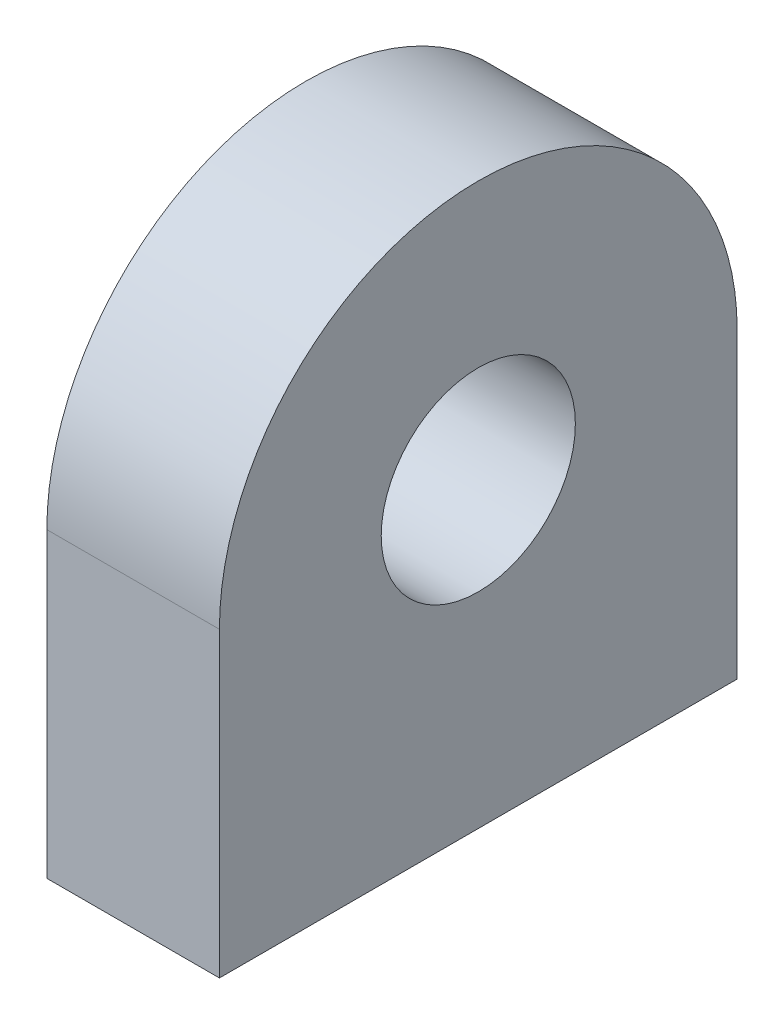
ISO-10303-21;
HEADER;
FILE_DESCRIPTION(('STEP AP214'),'2;1');
FILE_NAME('part.step','',(''),(''),'','','');
FILE_SCHEMA(('AUTOMOTIVE_DESIGN { 1 0 10303 214 1 1 1 1 }'));
ENDSEC;
DATA;
#1=APPLICATION_CONTEXT('core data for automotive mechanical design processes');
#2=APPLICATION_PROTOCOL_DEFINITION('international standard','automotive_design',2000,#1);
#3=PRODUCT_CONTEXT('',#1,'mechanical');
#4=PRODUCT('Part','Part','',(#3));
#5=PRODUCT_RELATED_PRODUCT_CATEGORY('part','',(#4));
#6=PRODUCT_DEFINITION_FORMATION('','',#4);
#7=PRODUCT_DEFINITION_CONTEXT('part definition',#1,'design');
#8=PRODUCT_DEFINITION('design','',#6,#7);
#9=PRODUCT_DEFINITION_SHAPE('','',#8);
#10=(LENGTH_UNIT() NAMED_UNIT(*) SI_UNIT(.MILLI.,.METRE.));
#11=(NAMED_UNIT(*) PLANE_ANGLE_UNIT() SI_UNIT($,.RADIAN.));
#12=(NAMED_UNIT(*) SI_UNIT($,.STERADIAN.) SOLID_ANGLE_UNIT());
#13=UNCERTAINTY_MEASURE_WITH_UNIT(LENGTH_MEASURE(1.E-05),#10,'distance_accuracy_value','');
#14=(GEOMETRIC_REPRESENTATION_CONTEXT(3) GLOBAL_UNCERTAINTY_ASSIGNED_CONTEXT((#13)) GLOBAL_UNIT_ASSIGNED_CONTEXT((#10,
#11,#12)) REPRESENTATION_CONTEXT('',''));
#15=CARTESIAN_POINT('',(0.,0.,0.));
#16=DIRECTION('',(0.,0.,1.));
#17=DIRECTION('',(1.,0.,0.));
#18=AXIS2_PLACEMENT_3D('',#15,#16,#17);
#19=CARTESIAN_POINT('',(12.7,44.45,0.));
#20=DIRECTION('',(-1.,0.,0.));
#21=DIRECTION('',(0.,0.,1.));
#22=AXIS2_PLACEMENT_3D('',#19,#20,#21);
#23=PLANE('',#22);
#24=DIRECTION('',(0.,-1.,0.));
#25=VECTOR('',#24,1.);
#26=CARTESIAN_POINT('',(12.7,0.,38.1));
#27=LINE('',#26,#25);
#28=CARTESIAN_POINT('',(12.7,44.45,38.1));
#29=VERTEX_POINT('',#28);
#30=CARTESIAN_POINT('',(12.7,0.,38.1));
#31=VERTEX_POINT('',#30);
#32=EDGE_CURVE('E85',#29,#31,#27,.T.);
#33=ORIENTED_EDGE('',*,*,#32,.T.);
#34=DIRECTION('',(0.,0.,-1.));
#35=VECTOR('',#34,1.);
#36=CARTESIAN_POINT('',(12.7,0.,38.1));
#37=LINE('',#36,#35);
#38=CARTESIAN_POINT('',(12.7,0.,-38.1));
#39=VERTEX_POINT('',#38);
#40=EDGE_CURVE('E80',#31,#39,#37,.T.);
#41=ORIENTED_EDGE('',*,*,#40,.T.);
#42=DIRECTION('',(0.,1.,0.));
#43=VECTOR('',#42,1.);
#44=CARTESIAN_POINT('',(12.7,0.,-38.1));
#45=LINE('',#44,#43);
#46=CARTESIAN_POINT('',(12.7,44.45,-38.1));
#47=VERTEX_POINT('',#46);
#48=EDGE_CURVE('E83',#39,#47,#45,.T.);
#49=ORIENTED_EDGE('',*,*,#48,.T.);
#50=CARTESIAN_POINT('',(12.7,44.45,0.));
#51=DIRECTION('',(1.,0.,0.));
#52=DIRECTION('',(0.,0.,1.));
#53=AXIS2_PLACEMENT_3D('',#50,#51,#52);
#54=CIRCLE('',#53,38.1);
#55=EDGE_CURVE('E50',#47,#29,#54,.T.);
#56=ORIENTED_EDGE('',*,*,#55,.T.);
#57=EDGE_LOOP('',(#33,#41,#49,#56));
#58=FACE_BOUND('',#57,.T.);
#59=CARTESIAN_POINT('',(12.7,44.45,0.));
#60=DIRECTION('',(1.,0.,0.));
#61=DIRECTION('',(0.,0.,-1.));
#62=AXIS2_PLACEMENT_3D('',#59,#60,#61);
#63=CIRCLE('',#62,14.2875);
#64=CARTESIAN_POINT('',(12.7,44.45,-14.2875));
#65=VERTEX_POINT('',#64);
#66=EDGE_CURVE('E100',#65,#65,#63,.T.);
#67=ORIENTED_EDGE('',*,*,#66,.F.);
#68=EDGE_LOOP('',(#67));
#69=FACE_BOUND('',#68,.T.);
#70=ADVANCED_FACE('F33',(#58,#69),#23,.F.);
#71=CARTESIAN_POINT('',(-12.7,44.45,0.));
#72=DIRECTION('',(-1.,0.,0.));
#73=DIRECTION('',(0.,0.,1.));
#74=AXIS2_PLACEMENT_3D('',#71,#72,#73);
#75=PLANE('',#74);
#76=DIRECTION('',(0.,-1.,0.));
#77=VECTOR('',#76,1.);
#78=CARTESIAN_POINT('',(-12.7,0.,38.1));
#79=LINE('',#78,#77);
#80=CARTESIAN_POINT('',(-12.7,44.45,38.1));
#81=VERTEX_POINT('',#80);
#82=CARTESIAN_POINT('',(-12.7,0.,38.1));
#83=VERTEX_POINT('',#82);
#84=EDGE_CURVE('E97',#81,#83,#79,.T.);
#85=ORIENTED_EDGE('',*,*,#84,.F.);
#86=CARTESIAN_POINT('',(-12.7,44.45,0.));
#87=DIRECTION('',(1.,0.,0.));
#88=DIRECTION('',(0.,0.,1.));
#89=AXIS2_PLACEMENT_3D('',#86,#87,#88);
#90=CIRCLE('',#89,38.1);
#91=CARTESIAN_POINT('',(-12.7,44.45,-38.1));
#92=VERTEX_POINT('',#91);
#93=EDGE_CURVE('E73',#92,#81,#90,.T.);
#94=ORIENTED_EDGE('',*,*,#93,.F.);
#95=DIRECTION('',(0.,1.,0.));
#96=VECTOR('',#95,1.);
#97=CARTESIAN_POINT('',(-12.7,0.,-38.1));
#98=LINE('',#97,#96);
#99=CARTESIAN_POINT('',(-12.7,0.,-38.1));
#100=VERTEX_POINT('',#99);
#101=EDGE_CURVE('E67',#100,#92,#98,.T.);
#102=ORIENTED_EDGE('',*,*,#101,.F.);
#103=DIRECTION('',(0.,0.,-1.));
#104=VECTOR('',#103,1.);
#105=CARTESIAN_POINT('',(-12.7,0.,38.1));
#106=LINE('',#105,#104);
#107=EDGE_CURVE('E89',#83,#100,#106,.T.);
#108=ORIENTED_EDGE('',*,*,#107,.F.);
#109=EDGE_LOOP('',(#85,#94,#102,#108));
#110=FACE_BOUND('',#109,.T.);
#111=CARTESIAN_POINT('',(-12.7,44.45,0.));
#112=DIRECTION('',(1.,0.,0.));
#113=DIRECTION('',(0.,0.,-1.));
#114=AXIS2_PLACEMENT_3D('',#111,#112,#113);
#115=CIRCLE('',#114,14.2875);
#116=CARTESIAN_POINT('',(-12.7,44.45,-14.2875));
#117=VERTEX_POINT('',#116);
#118=EDGE_CURVE('E112',#117,#117,#115,.T.);
#119=ORIENTED_EDGE('',*,*,#118,.T.);
#120=EDGE_LOOP('',(#119));
#121=FACE_BOUND('',#120,.T.);
#122=ADVANCED_FACE('F108',(#110,#121),#75,.T.);
#123=CARTESIAN_POINT('',(12.7,0.,38.1));
#124=DIRECTION('',(0.,0.,-1.));
#125=DIRECTION('',(-1.,0.,0.));
#126=AXIS2_PLACEMENT_3D('',#123,#124,#125);
#127=PLANE('',#126);
#128=ORIENTED_EDGE('',*,*,#84,.T.);
#129=DIRECTION('',(-1.,0.,0.));
#130=VECTOR('',#129,1.);
#131=CARTESIAN_POINT('',(12.7,0.,38.1));
#132=LINE('',#131,#130);
#133=EDGE_CURVE('E11',#31,#83,#132,.T.);
#134=ORIENTED_EDGE('',*,*,#133,.F.);
#135=ORIENTED_EDGE('',*,*,#32,.F.);
#136=DIRECTION('',(-1.,0.,0.));
#137=VECTOR('',#136,1.);
#138=CARTESIAN_POINT('',(12.7,44.45,38.1));
#139=LINE('',#138,#137);
#140=EDGE_CURVE('E93',#29,#81,#139,.T.);
#141=ORIENTED_EDGE('',*,*,#140,.T.);
#142=EDGE_LOOP('',(#128,#134,#135,#141));
#143=FACE_BOUND('',#142,.T.);
#144=ADVANCED_FACE('F35',(#143),#127,.F.);
#145=CARTESIAN_POINT('',(12.7,0.,38.1));
#146=DIRECTION('',(0.,1.,0.));
#147=DIRECTION('',(0.,0.,1.));
#148=AXIS2_PLACEMENT_3D('',#145,#146,#147);
#149=PLANE('',#148);
#150=ORIENTED_EDGE('',*,*,#107,.T.);
#151=DIRECTION('',(-1.,0.,0.));
#152=VECTOR('',#151,1.);
#153=CARTESIAN_POINT('',(12.7,0.,-38.1));
#154=LINE('',#153,#152);
#155=EDGE_CURVE('E42',#39,#100,#154,.T.);
#156=ORIENTED_EDGE('',*,*,#155,.F.);
#157=ORIENTED_EDGE('',*,*,#40,.F.);
#158=ORIENTED_EDGE('',*,*,#133,.T.);
#159=EDGE_LOOP('',(#150,#156,#157,#158));
#160=FACE_BOUND('',#159,.T.);
#161=ADVANCED_FACE('F88',(#160),#149,.F.);
#162=CARTESIAN_POINT('',(12.7,0.,-38.1));
#163=DIRECTION('',(0.,0.,1.));
#164=DIRECTION('',(1.,0.,0.));
#165=AXIS2_PLACEMENT_3D('',#162,#163,#164);
#166=PLANE('',#165);
#167=ORIENTED_EDGE('',*,*,#101,.T.);
#168=DIRECTION('',(-1.,0.,0.));
#169=VECTOR('',#168,1.);
#170=CARTESIAN_POINT('',(12.7,44.45,-38.1));
#171=LINE('',#170,#169);
#172=EDGE_CURVE('E90',#47,#92,#171,.T.);
#173=ORIENTED_EDGE('',*,*,#172,.F.);
#174=ORIENTED_EDGE('',*,*,#48,.F.);
#175=ORIENTED_EDGE('',*,*,#155,.T.);
#176=EDGE_LOOP('',(#167,#173,#174,#175));
#177=FACE_BOUND('',#176,.T.);
#178=ADVANCED_FACE('F91',(#177),#166,.F.);
#179=CARTESIAN_POINT('',(12.7,44.45,0.));
#180=DIRECTION('',(-1.,0.,0.));
#181=DIRECTION('',(0.,0.,1.));
#182=AXIS2_PLACEMENT_3D('',#179,#180,#181);
#183=CYLINDRICAL_SURFACE('',#182,38.1);
#184=ORIENTED_EDGE('',*,*,#93,.T.);
#185=ORIENTED_EDGE('',*,*,#140,.F.);
#186=ORIENTED_EDGE('',*,*,#55,.F.);
#187=ORIENTED_EDGE('',*,*,#172,.T.);
#188=EDGE_LOOP('',(#184,#185,#186,#187));
#189=FACE_BOUND('',#188,.T.);
#190=ADVANCED_FACE('F105',(#189),#183,.T.);
#191=CARTESIAN_POINT('',(12.7,44.45,0.));
#192=DIRECTION('',(-1.,0.,0.));
#193=DIRECTION('',(0.,0.,1.));
#194=AXIS2_PLACEMENT_3D('',#191,#192,#193);
#195=CYLINDRICAL_SURFACE('',#194,14.2875);
#196=ORIENTED_EDGE('',*,*,#66,.T.);
#197=EDGE_LOOP('',(#196));
#198=FACE_BOUND('',#197,.T.);
#199=ORIENTED_EDGE('',*,*,#118,.F.);
#200=EDGE_LOOP('',(#199));
#201=FACE_BOUND('',#200,.T.);
#202=ADVANCED_FACE('F118',(#198,#201),#195,.F.);
#203=CLOSED_SHELL('',(#70,#122,#144,#161,#178,#190,#202));
#204=MANIFOLD_SOLID_BREP('B2',#203);
#205=ADVANCED_BREP_SHAPE_REPRESENTATION('',(#18,#204),#14);
#206=SHAPE_DEFINITION_REPRESENTATION(#9,#205);
ENDSEC;
END-ISO-10303-21;
